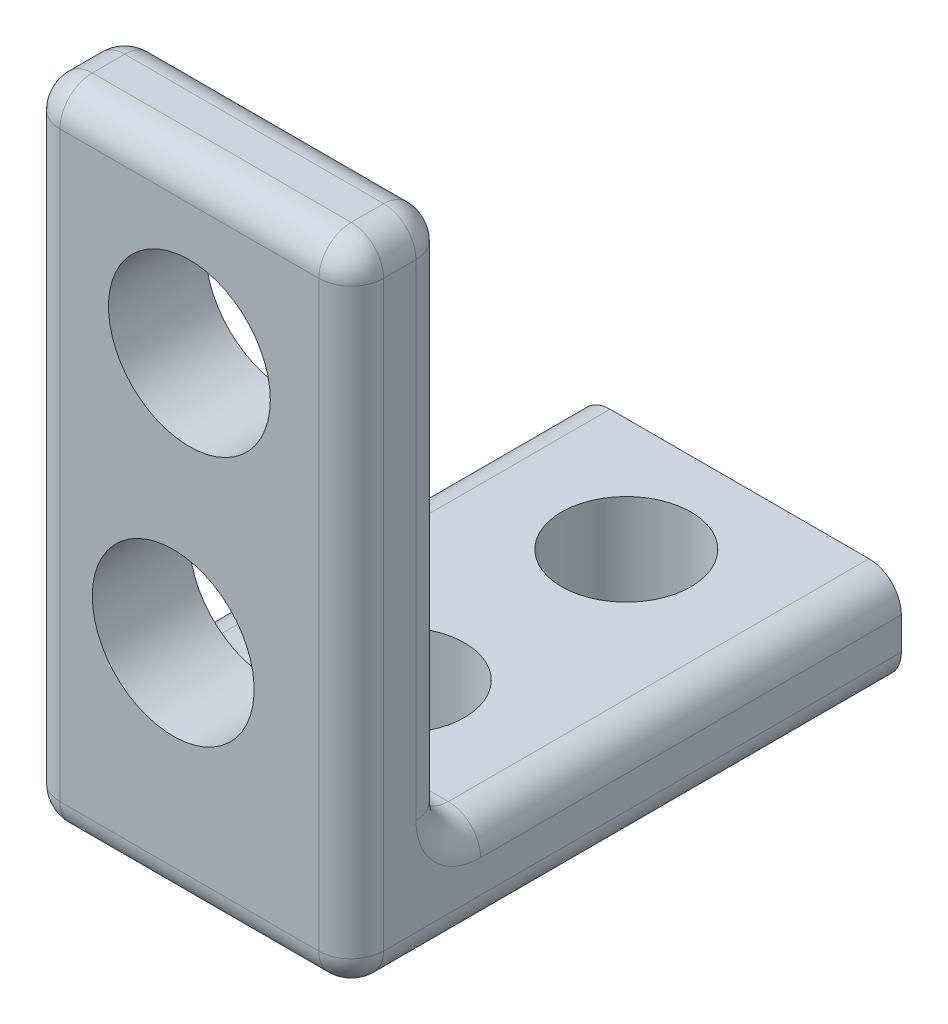
ISO-10303-21;
HEADER;
FILE_DESCRIPTION(('STEP AP214'),'2;1');
FILE_NAME('part.step','',(''),(''),'','','');
FILE_SCHEMA(('AUTOMOTIVE_DESIGN { 1 0 10303 214 1 1 1 1 }'));
ENDSEC;
DATA;
#1=APPLICATION_CONTEXT('core data for automotive mechanical design processes');
#2=APPLICATION_PROTOCOL_DEFINITION('international standard','automotive_design',2000,#1);
#3=PRODUCT_CONTEXT('',#1,'mechanical');
#4=PRODUCT('Part','Part','',(#3));
#5=PRODUCT_RELATED_PRODUCT_CATEGORY('part','',(#4));
#6=PRODUCT_DEFINITION_FORMATION('','',#4);
#7=PRODUCT_DEFINITION_CONTEXT('part definition',#1,'design');
#8=PRODUCT_DEFINITION('design','',#6,#7);
#9=PRODUCT_DEFINITION_SHAPE('','',#8);
#10=(LENGTH_UNIT() NAMED_UNIT(*) SI_UNIT(.MILLI.,.METRE.));
#11=(NAMED_UNIT(*) PLANE_ANGLE_UNIT() SI_UNIT($,.RADIAN.));
#12=(NAMED_UNIT(*) SI_UNIT($,.STERADIAN.) SOLID_ANGLE_UNIT());
#13=UNCERTAINTY_MEASURE_WITH_UNIT(LENGTH_MEASURE(1.E-05),#10,'distance_accuracy_value','');
#14=(GEOMETRIC_REPRESENTATION_CONTEXT(3) GLOBAL_UNCERTAINTY_ASSIGNED_CONTEXT((#13)) GLOBAL_UNIT_ASSIGNED_CONTEXT((#10,
#11,#12)) REPRESENTATION_CONTEXT('',''));
#15=CARTESIAN_POINT('',(0.,0.,0.));
#16=DIRECTION('',(0.,0.,1.));
#17=DIRECTION('',(1.,0.,0.));
#18=AXIS2_PLACEMENT_3D('',#15,#16,#17);
#19=CARTESIAN_POINT('',(0.,20.,0.));
#20=DIRECTION('',(1.,0.,0.));
#21=DIRECTION('',(0.,0.,-1.));
#22=AXIS2_PLACEMENT_3D('',#19,#20,#21);
#23=PLANE('',#22);
#24=DIRECTION('',(0.,1.,0.));
#25=VECTOR('',#24,1.);
#26=CARTESIAN_POINT('',(0.,0.,-17.));
#27=LINE('',#26,#25);
#28=CARTESIAN_POINT('',(0.,1.,-17.));
#29=VERTEX_POINT('',#28);
#30=CARTESIAN_POINT('',(0.,2.,-17.));
#31=VERTEX_POINT('',#30);
#32=EDGE_CURVE('E391',#29,#31,#27,.T.);
#33=ORIENTED_EDGE('',*,*,#32,.F.);
#34=DIRECTION('',(0.,0.,1.));
#35=VECTOR('',#34,1.);
#36=CARTESIAN_POINT('',(0.,1.,0.));
#37=LINE('',#36,#35);
#38=CARTESIAN_POINT('',(0.,1.,-1.));
#39=VERTEX_POINT('',#38);
#40=EDGE_CURVE('E236',#29,#39,#37,.T.);
#41=ORIENTED_EDGE('',*,*,#40,.T.);
#42=DIRECTION('',(0.,-1.,0.));
#43=VECTOR('',#42,1.);
#44=CARTESIAN_POINT('',(0.,20.,-1.));
#45=LINE('',#44,#43);
#46=CARTESIAN_POINT('',(0.,19.,-1.));
#47=VERTEX_POINT('',#46);
#48=EDGE_CURVE('E233',#39,#47,#45,.F.);
#49=ORIENTED_EDGE('',*,*,#48,.T.);
#50=DIRECTION('',(0.,0.,1.));
#51=VECTOR('',#50,1.);
#52=CARTESIAN_POINT('',(0.,19.,0.));
#53=LINE('',#52,#51);
#54=CARTESIAN_POINT('',(0.,19.,-2.));
#55=VERTEX_POINT('',#54);
#56=EDGE_CURVE('E229',#47,#55,#53,.F.);
#57=ORIENTED_EDGE('',*,*,#56,.T.);
#58=DIRECTION('',(0.,1.,0.));
#59=VECTOR('',#58,1.);
#60=CARTESIAN_POINT('',(0.,20.,-2.));
#61=LINE('',#60,#59);
#62=CARTESIAN_POINT('',(0.,4.,-2.));
#63=VERTEX_POINT('',#62);
#64=EDGE_CURVE('E223',#55,#63,#61,.F.);
#65=ORIENTED_EDGE('',*,*,#64,.T.);
#66=CARTESIAN_POINT('',(0.,4.,-4.));
#67=DIRECTION('',(1.,0.,0.));
#68=DIRECTION('',(0.,0.,-1.));
#69=AXIS2_PLACEMENT_3D('',#66,#67,#68);
#70=CIRCLE('',#69,2.);
#71=CARTESIAN_POINT('',(0.,2.,-4.));
#72=VERTEX_POINT('',#71);
#73=EDGE_CURVE('E219',#72,#63,#70,.F.);
#74=ORIENTED_EDGE('',*,*,#73,.F.);
#75=DIRECTION('',(0.,0.,1.));
#76=VECTOR('',#75,1.);
#77=CARTESIAN_POINT('',(0.,2.,-17.));
#78=LINE('',#77,#76);
#79=EDGE_CURVE('E226',#72,#31,#78,.F.);
#80=ORIENTED_EDGE('',*,*,#79,.T.);
#81=EDGE_LOOP('',(#33,#41,#49,#57,#65,#74,#80));
#82=FACE_BOUND('',#81,.T.);
#83=ADVANCED_FACE('F42',(#82),#23,.F.);
#84=CARTESIAN_POINT('',(0.,20.,0.));
#85=DIRECTION('',(0.,0.,-1.));
#86=DIRECTION('',(-1.,0.,0.));
#87=AXIS2_PLACEMENT_3D('',#84,#85,#86);
#88=PLANE('',#87);
#89=CARTESIAN_POINT('',(4.5,7.,0.));
#90=DIRECTION('',(0.,0.,-1.));
#91=DIRECTION('',(-1.,0.,0.));
#92=AXIS2_PLACEMENT_3D('',#89,#90,#91);
#93=CIRCLE('',#92,2.5);
#94=CARTESIAN_POINT('',(2.,7.,0.));
#95=VERTEX_POINT('',#94);
#96=EDGE_CURVE('E174',#95,#95,#93,.T.);
#97=ORIENTED_EDGE('',*,*,#96,.T.);
#98=EDGE_LOOP('',(#97));
#99=FACE_BOUND('',#98,.T.);
#100=DIRECTION('',(1.,0.,0.));
#101=VECTOR('',#100,1.);
#102=CARTESIAN_POINT('',(10.,1.,0.));
#103=LINE('',#102,#101);
#104=CARTESIAN_POINT('',(1.,1.,0.));
#105=VERTEX_POINT('',#104);
#106=CARTESIAN_POINT('',(9.,1.,0.));
#107=VERTEX_POINT('',#106);
#108=EDGE_CURVE('E207',#105,#107,#103,.T.);
#109=ORIENTED_EDGE('',*,*,#108,.T.);
#110=DIRECTION('',(0.,-1.,0.));
#111=VECTOR('',#110,1.);
#112=CARTESIAN_POINT('',(9.,20.,0.));
#113=LINE('',#112,#111);
#114=CARTESIAN_POINT('',(9.,19.,0.));
#115=VERTEX_POINT('',#114);
#116=EDGE_CURVE('E216',#107,#115,#113,.F.);
#117=ORIENTED_EDGE('',*,*,#116,.T.);
#118=DIRECTION('',(1.,0.,0.));
#119=VECTOR('',#118,1.);
#120=CARTESIAN_POINT('',(0.,19.,0.));
#121=LINE('',#120,#119);
#122=CARTESIAN_POINT('',(1.,19.,0.));
#123=VERTEX_POINT('',#122);
#124=EDGE_CURVE('E169',#115,#123,#121,.F.);
#125=ORIENTED_EDGE('',*,*,#124,.T.);
#126=DIRECTION('',(0.,-1.,0.));
#127=VECTOR('',#126,1.);
#128=CARTESIAN_POINT('',(1.,20.,0.));
#129=LINE('',#128,#127);
#130=EDGE_CURVE('E203',#123,#105,#129,.T.);
#131=ORIENTED_EDGE('',*,*,#130,.T.);
#132=EDGE_LOOP('',(#109,#117,#125,#131));
#133=FACE_BOUND('',#132,.T.);
#134=CARTESIAN_POINT('',(5.,15.,0.));
#135=DIRECTION('',(0.,0.,1.));
#136=DIRECTION('',(1.,0.,0.));
#137=AXIS2_PLACEMENT_3D('',#134,#135,#136);
#138=CIRCLE('',#137,2.5);
#139=CARTESIAN_POINT('',(7.5,15.,0.));
#140=VERTEX_POINT('',#139);
#141=EDGE_CURVE('E401',#140,#140,#138,.T.);
#142=ORIENTED_EDGE('',*,*,#141,.F.);
#143=EDGE_LOOP('',(#142));
#144=FACE_BOUND('',#143,.T.);
#145=ADVANCED_FACE('F435',(#99,#133,#144),#88,.F.);
#146=CARTESIAN_POINT('',(10.,20.,0.));
#147=DIRECTION('',(-1.,0.,0.));
#148=DIRECTION('',(0.,0.,1.));
#149=AXIS2_PLACEMENT_3D('',#146,#147,#148);
#150=PLANE('',#149);
#151=DIRECTION('',(0.,-1.,0.));
#152=VECTOR('',#151,1.);
#153=CARTESIAN_POINT('',(10.,20.,-1.));
#154=LINE('',#153,#152);
#155=CARTESIAN_POINT('',(10.,19.,-1.));
#156=VERTEX_POINT('',#155);
#157=CARTESIAN_POINT('',(10.,1.,-1.));
#158=VERTEX_POINT('',#157);
#159=EDGE_CURVE('E265',#156,#158,#154,.T.);
#160=ORIENTED_EDGE('',*,*,#159,.T.);
#161=DIRECTION('',(0.,0.,-1.));
#162=VECTOR('',#161,1.);
#163=CARTESIAN_POINT('',(10.,1.,-17.));
#164=LINE('',#163,#162);
#165=CARTESIAN_POINT('',(10.,1.,-17.));
#166=VERTEX_POINT('',#165);
#167=EDGE_CURVE('E268',#158,#166,#164,.T.);
#168=ORIENTED_EDGE('',*,*,#167,.T.);
#169=DIRECTION('',(0.,1.,0.));
#170=VECTOR('',#169,1.);
#171=CARTESIAN_POINT('',(10.,0.,-17.));
#172=LINE('',#171,#170);
#173=CARTESIAN_POINT('',(10.,2.,-17.));
#174=VERTEX_POINT('',#173);
#175=EDGE_CURVE('E397',#166,#174,#172,.T.);
#176=ORIENTED_EDGE('',*,*,#175,.T.);
#177=DIRECTION('',(0.,0.,-1.));
#178=VECTOR('',#177,1.);
#179=CARTESIAN_POINT('',(10.,2.,-3.));
#180=LINE('',#179,#178);
#181=CARTESIAN_POINT('',(10.,2.,-4.));
#182=VERTEX_POINT('',#181);
#183=EDGE_CURVE('E256',#174,#182,#180,.F.);
#184=ORIENTED_EDGE('',*,*,#183,.T.);
#185=CARTESIAN_POINT('',(10.,4.,-4.));
#186=DIRECTION('',(-1.,0.,0.));
#187=DIRECTION('',(0.,0.,1.));
#188=AXIS2_PLACEMENT_3D('',#185,#186,#187);
#189=CIRCLE('',#188,2.);
#190=CARTESIAN_POINT('',(10.,4.,-2.));
#191=VERTEX_POINT('',#190);
#192=EDGE_CURVE('E252',#191,#182,#189,.F.);
#193=ORIENTED_EDGE('',*,*,#192,.F.);
#194=DIRECTION('',(0.,1.,0.));
#195=VECTOR('',#194,1.);
#196=CARTESIAN_POINT('',(10.,20.,-2.));
#197=LINE('',#196,#195);
#198=CARTESIAN_POINT('',(10.,19.,-2.));
#199=VERTEX_POINT('',#198);
#200=EDGE_CURVE('E259',#191,#199,#197,.T.);
#201=ORIENTED_EDGE('',*,*,#200,.T.);
#202=DIRECTION('',(0.,0.,-1.));
#203=VECTOR('',#202,1.);
#204=CARTESIAN_POINT('',(10.,19.,0.));
#205=LINE('',#204,#203);
#206=EDGE_CURVE('E262',#199,#156,#205,.F.);
#207=ORIENTED_EDGE('',*,*,#206,.T.);
#208=EDGE_LOOP('',(#160,#168,#176,#184,#193,#201,#207));
#209=FACE_BOUND('',#208,.T.);
#210=ADVANCED_FACE('F445',(#209),#150,.F.);
#211=CARTESIAN_POINT('',(0.,20.,0.));
#212=DIRECTION('',(0.,-1.,0.));
#213=DIRECTION('',(0.,0.,-1.));
#214=AXIS2_PLACEMENT_3D('',#211,#212,#213);
#215=PLANE('',#214);
#216=DIRECTION('',(0.,0.,1.));
#217=VECTOR('',#216,1.);
#218=CARTESIAN_POINT('',(1.,20.,0.));
#219=LINE('',#218,#217);
#220=CARTESIAN_POINT('',(1.,20.,-2.));
#221=VERTEX_POINT('',#220);
#222=CARTESIAN_POINT('',(1.,20.,-1.));
#223=VERTEX_POINT('',#222);
#224=EDGE_CURVE('E200',#221,#223,#219,.T.);
#225=ORIENTED_EDGE('',*,*,#224,.T.);
#226=DIRECTION('',(1.,0.,0.));
#227=VECTOR('',#226,1.);
#228=CARTESIAN_POINT('',(0.,20.,-1.));
#229=LINE('',#228,#227);
#230=CARTESIAN_POINT('',(9.,20.,-1.));
#231=VERTEX_POINT('',#230);
#232=EDGE_CURVE('E167',#223,#231,#229,.T.);
#233=ORIENTED_EDGE('',*,*,#232,.T.);
#234=DIRECTION('',(0.,0.,-1.));
#235=VECTOR('',#234,1.);
#236=CARTESIAN_POINT('',(9.,20.,0.));
#237=LINE('',#236,#235);
#238=CARTESIAN_POINT('',(9.,20.,-2.));
#239=VERTEX_POINT('',#238);
#240=EDGE_CURVE('E188',#231,#239,#237,.T.);
#241=ORIENTED_EDGE('',*,*,#240,.T.);
#242=DIRECTION('',(1.,0.,0.));
#243=VECTOR('',#242,1.);
#244=CARTESIAN_POINT('',(0.,20.,-2.));
#245=LINE('',#244,#243);
#246=EDGE_CURVE('E195',#239,#221,#245,.F.);
#247=ORIENTED_EDGE('',*,*,#246,.T.);
#248=EDGE_LOOP('',(#225,#233,#241,#247));
#249=FACE_BOUND('',#248,.T.);
#250=ADVANCED_FACE('F198',(#249),#215,.F.);
#251=CARTESIAN_POINT('',(0.,0.,0.));
#252=DIRECTION('',(0.,-1.,0.));
#253=DIRECTION('',(0.,0.,-1.));
#254=AXIS2_PLACEMENT_3D('',#251,#252,#253);
#255=PLANE('',#254);
#256=CARTESIAN_POINT('',(5.,0.,-6.5));
#257=DIRECTION('',(0.,1.,0.));
#258=DIRECTION('',(0.,0.,1.));
#259=AXIS2_PLACEMENT_3D('',#256,#257,#258);
#260=CIRCLE('',#259,2.);
#261=CARTESIAN_POINT('',(5.,0.,-4.5));
#262=VERTEX_POINT('',#261);
#263=EDGE_CURVE('E396',#262,#262,#260,.T.);
#264=ORIENTED_EDGE('',*,*,#263,.T.);
#265=EDGE_LOOP('',(#264));
#266=FACE_BOUND('',#265,.T.);
#267=CARTESIAN_POINT('',(5.,0.,-13.5));
#268=DIRECTION('',(0.,1.,0.));
#269=DIRECTION('',(0.,0.,1.));
#270=AXIS2_PLACEMENT_3D('',#267,#268,#269);
#271=CIRCLE('',#270,2.);
#272=CARTESIAN_POINT('',(5.,0.,-11.5));
#273=VERTEX_POINT('',#272);
#274=EDGE_CURVE('E373',#273,#273,#271,.T.);
#275=ORIENTED_EDGE('',*,*,#274,.T.);
#276=EDGE_LOOP('',(#275));
#277=FACE_BOUND('',#276,.T.);
#278=DIRECTION('',(1.,0.,0.));
#279=VECTOR('',#278,1.);
#280=CARTESIAN_POINT('',(10.,0.,-17.));
#281=LINE('',#280,#279);
#282=CARTESIAN_POINT('',(0.999999999999999,0.,-17.));
#283=VERTEX_POINT('',#282);
#284=CARTESIAN_POINT('',(9.,0.,-17.));
#285=VERTEX_POINT('',#284);
#286=EDGE_CURVE('E387',#283,#285,#281,.T.);
#287=ORIENTED_EDGE('',*,*,#286,.T.);
#288=DIRECTION('',(0.,0.,-1.));
#289=VECTOR('',#288,1.);
#290=CARTESIAN_POINT('',(9.,0.,0.));
#291=LINE('',#290,#289);
#292=CARTESIAN_POINT('',(9.,0.,-1.));
#293=VERTEX_POINT('',#292);
#294=EDGE_CURVE('E277',#285,#293,#291,.F.);
#295=ORIENTED_EDGE('',*,*,#294,.T.);
#296=DIRECTION('',(1.,0.,0.));
#297=VECTOR('',#296,1.);
#298=CARTESIAN_POINT('',(0.,0.,-1.));
#299=LINE('',#298,#297);
#300=CARTESIAN_POINT('',(1.,0.,-1.));
#301=VERTEX_POINT('',#300);
#302=EDGE_CURVE('E274',#293,#301,#299,.F.);
#303=ORIENTED_EDGE('',*,*,#302,.T.);
#304=DIRECTION('',(0.,0.,1.));
#305=VECTOR('',#304,1.);
#306=CARTESIAN_POINT('',(1.,0.,-17.));
#307=LINE('',#306,#305);
#308=EDGE_CURVE('E271',#301,#283,#307,.F.);
#309=ORIENTED_EDGE('',*,*,#308,.T.);
#310=EDGE_LOOP('',(#287,#295,#303,#309));
#311=FACE_BOUND('',#310,.T.);
#312=ADVANCED_FACE('F460',(#266,#277,#311),#255,.T.);
#313=CARTESIAN_POINT('',(0.,3.,-3.));
#314=DIRECTION('',(0.,0.,1.));
#315=DIRECTION('',(1.,0.,0.));
#316=AXIS2_PLACEMENT_3D('',#313,#314,#315);
#317=PLANE('',#316);
#318=CARTESIAN_POINT('',(4.5,7.,-3.));
#319=DIRECTION('',(0.,0.,-1.));
#320=DIRECTION('',(-1.,0.,0.));
#321=AXIS2_PLACEMENT_3D('',#318,#319,#320);
#322=CIRCLE('',#321,2.5);
#323=CARTESIAN_POINT('',(2.,7.,-3.));
#324=VERTEX_POINT('',#323);
#325=EDGE_CURVE('E866',#324,#324,#322,.T.);
#326=ORIENTED_EDGE('',*,*,#325,.F.);
#327=EDGE_LOOP('',(#326));
#328=FACE_BOUND('',#327,.T.);
#329=DIRECTION('',(1.,0.,0.));
#330=VECTOR('',#329,1.);
#331=CARTESIAN_POINT('',(0.,19.,-3.));
#332=LINE('',#331,#330);
#333=CARTESIAN_POINT('',(1.,19.,-3.));
#334=VERTEX_POINT('',#333);
#335=CARTESIAN_POINT('',(9.,19.,-3.));
#336=VERTEX_POINT('',#335);
#337=EDGE_CURVE('E245',#334,#336,#332,.T.);
#338=ORIENTED_EDGE('',*,*,#337,.T.);
#339=DIRECTION('',(0.,1.,0.));
#340=VECTOR('',#339,1.);
#341=CARTESIAN_POINT('',(9.,3.,-3.));
#342=LINE('',#341,#340);
#343=CARTESIAN_POINT('',(9.,4.,-3.));
#344=VERTEX_POINT('',#343);
#345=EDGE_CURVE('E249',#336,#344,#342,.F.);
#346=ORIENTED_EDGE('',*,*,#345,.T.);
#347=DIRECTION('',(1.,0.,0.));
#348=VECTOR('',#347,1.);
#349=CARTESIAN_POINT('',(0.,4.,-3.));
#350=LINE('',#349,#348);
#351=CARTESIAN_POINT('',(1.,4.,-3.));
#352=VERTEX_POINT('',#351);
#353=EDGE_CURVE('E242',#344,#352,#350,.F.);
#354=ORIENTED_EDGE('',*,*,#353,.T.);
#355=DIRECTION('',(0.,1.,0.));
#356=VECTOR('',#355,1.);
#357=CARTESIAN_POINT('',(1.,3.,-3.));
#358=LINE('',#357,#356);
#359=EDGE_CURVE('E239',#352,#334,#358,.T.);
#360=ORIENTED_EDGE('',*,*,#359,.T.);
#361=EDGE_LOOP('',(#338,#346,#354,#360));
#362=FACE_BOUND('',#361,.T.);
#363=CARTESIAN_POINT('',(5.,15.,-3.));
#364=DIRECTION('',(0.,0.,1.));
#365=DIRECTION('',(1.,0.,0.));
#366=AXIS2_PLACEMENT_3D('',#363,#364,#365);
#367=CIRCLE('',#366,2.5);
#368=CARTESIAN_POINT('',(7.5,15.,-3.));
#369=VERTEX_POINT('',#368);
#370=EDGE_CURVE('E196',#369,#369,#367,.T.);
#371=ORIENTED_EDGE('',*,*,#370,.T.);
#372=EDGE_LOOP('',(#371));
#373=FACE_BOUND('',#372,.T.);
#374=ADVANCED_FACE('F569',(#328,#362,#373),#317,.F.);
#375=CARTESIAN_POINT('',(0.,3.,0.));
#376=DIRECTION('',(0.,1.,0.));
#377=DIRECTION('',(0.,0.,1.));
#378=AXIS2_PLACEMENT_3D('',#375,#376,#377);
#379=PLANE('',#378);
#380=CARTESIAN_POINT('',(5.,3.,-6.5));
#381=DIRECTION('',(0.,1.,0.));
#382=DIRECTION('',(0.,0.,1.));
#383=AXIS2_PLACEMENT_3D('',#380,#381,#382);
#384=CIRCLE('',#383,2.);
#385=CARTESIAN_POINT('',(5.,3.,-4.5));
#386=VERTEX_POINT('',#385);
#387=EDGE_CURVE('E383',#386,#386,#384,.T.);
#388=ORIENTED_EDGE('',*,*,#387,.F.);
#389=EDGE_LOOP('',(#388));
#390=FACE_BOUND('',#389,.T.);
#391=CARTESIAN_POINT('',(5.,3.,-13.5));
#392=DIRECTION('',(0.,1.,0.));
#393=DIRECTION('',(0.,0.,1.));
#394=AXIS2_PLACEMENT_3D('',#391,#392,#393);
#395=CIRCLE('',#394,2.);
#396=CARTESIAN_POINT('',(5.,3.,-11.5));
#397=VERTEX_POINT('',#396);
#398=EDGE_CURVE('E377',#397,#397,#395,.T.);
#399=ORIENTED_EDGE('',*,*,#398,.F.);
#400=EDGE_LOOP('',(#399));
#401=FACE_BOUND('',#400,.T.);
#402=DIRECTION('',(1.,0.,0.));
#403=VECTOR('',#402,1.);
#404=CARTESIAN_POINT('',(0.,3.,-4.));
#405=LINE('',#404,#403);
#406=CARTESIAN_POINT('',(1.,3.,-4.));
#407=VERTEX_POINT('',#406);
#408=CARTESIAN_POINT('',(9.,3.,-4.));
#409=VERTEX_POINT('',#408);
#410=EDGE_CURVE('E60',#407,#409,#405,.T.);
#411=ORIENTED_EDGE('',*,*,#410,.T.);
#412=DIRECTION('',(0.,0.,-1.));
#413=VECTOR('',#412,1.);
#414=CARTESIAN_POINT('',(9.,3.,-17.));
#415=LINE('',#414,#413);
#416=CARTESIAN_POINT('',(9.,3.,-17.));
#417=VERTEX_POINT('',#416);
#418=EDGE_CURVE('E284',#409,#417,#415,.T.);
#419=ORIENTED_EDGE('',*,*,#418,.T.);
#420=DIRECTION('',(1.,0.,0.));
#421=VECTOR('',#420,1.);
#422=CARTESIAN_POINT('',(10.,3.,-17.));
#423=LINE('',#422,#421);
#424=CARTESIAN_POINT('',(0.999999999999999,3.,-17.));
#425=VERTEX_POINT('',#424);
#426=EDGE_CURVE('E392',#425,#417,#423,.T.);
#427=ORIENTED_EDGE('',*,*,#426,.F.);
#428=DIRECTION('',(0.,0.,1.));
#429=VECTOR('',#428,1.);
#430=CARTESIAN_POINT('',(1.,3.,-3.));
#431=LINE('',#430,#429);
#432=EDGE_CURVE('E65',#425,#407,#431,.T.);
#433=ORIENTED_EDGE('',*,*,#432,.T.);
#434=EDGE_LOOP('',(#411,#419,#427,#433));
#435=FACE_BOUND('',#434,.T.);
#436=ADVANCED_FACE('F475',(#390,#401,#435),#379,.T.);
#437=CARTESIAN_POINT('',(5.,15.,-20.));
#438=DIRECTION('',(0.,0.,1.));
#439=DIRECTION('',(1.,0.,0.));
#440=AXIS2_PLACEMENT_3D('',#437,#438,#439);
#441=CYLINDRICAL_SURFACE('',#440,2.5);
#442=ORIENTED_EDGE('',*,*,#141,.T.);
#443=EDGE_LOOP('',(#442));
#444=FACE_BOUND('',#443,.T.);
#445=ORIENTED_EDGE('',*,*,#370,.F.);
#446=EDGE_LOOP('',(#445));
#447=FACE_BOUND('',#446,.T.);
#448=ADVANCED_FACE('F615',(#444,#447),#441,.F.);
#449=CARTESIAN_POINT('',(10.,0.,-17.));
#450=DIRECTION('',(0.,0.,1.));
#451=DIRECTION('',(1.,0.,0.));
#452=AXIS2_PLACEMENT_3D('',#449,#450,#451);
#453=PLANE('',#452);
#454=ORIENTED_EDGE('',*,*,#175,.F.);
#455=CARTESIAN_POINT('',(9.,1.,-17.));
#456=DIRECTION('',(0.,0.,1.));
#457=DIRECTION('',(1.,0.,0.));
#458=AXIS2_PLACEMENT_3D('',#455,#456,#457);
#459=CIRCLE('',#458,1.);
#460=EDGE_CURVE('E11',#166,#285,#459,.F.);
#461=ORIENTED_EDGE('',*,*,#460,.T.);
#462=ORIENTED_EDGE('',*,*,#286,.F.);
#463=CARTESIAN_POINT('',(1.,1.,-17.));
#464=DIRECTION('',(0.,0.,1.));
#465=DIRECTION('',(1.,0.,0.));
#466=AXIS2_PLACEMENT_3D('',#463,#464,#465);
#467=CIRCLE('',#466,1.);
#468=EDGE_CURVE('E290',#283,#29,#467,.F.);
#469=ORIENTED_EDGE('',*,*,#468,.T.);
#470=ORIENTED_EDGE('',*,*,#32,.T.);
#471=CARTESIAN_POINT('',(1.,2.,-17.));
#472=DIRECTION('',(0.,0.,1.));
#473=DIRECTION('',(1.,0.,0.));
#474=AXIS2_PLACEMENT_3D('',#471,#472,#473);
#475=CIRCLE('',#474,1.);
#476=EDGE_CURVE('E287',#31,#425,#475,.F.);
#477=ORIENTED_EDGE('',*,*,#476,.T.);
#478=ORIENTED_EDGE('',*,*,#426,.T.);
#479=CARTESIAN_POINT('',(9.,2.,-17.));
#480=DIRECTION('',(0.,0.,1.));
#481=DIRECTION('',(1.,0.,0.));
#482=AXIS2_PLACEMENT_3D('',#479,#480,#481);
#483=CIRCLE('',#482,1.);
#484=EDGE_CURVE('E52',#417,#174,#483,.F.);
#485=ORIENTED_EDGE('',*,*,#484,.T.);
#486=EDGE_LOOP('',(#454,#461,#462,#469,#470,#477,#478,#485));
#487=FACE_BOUND('',#486,.T.);
#488=ADVANCED_FACE('F469',(#487),#453,.F.);
#489=CARTESIAN_POINT('',(5.,0.,-13.5));
#490=DIRECTION('',(0.,1.,0.));
#491=DIRECTION('',(0.,0.,1.));
#492=AXIS2_PLACEMENT_3D('',#489,#490,#491);
#493=CYLINDRICAL_SURFACE('',#492,2.);
#494=ORIENTED_EDGE('',*,*,#274,.F.);
#495=EDGE_LOOP('',(#494));
#496=FACE_BOUND('',#495,.T.);
#497=ORIENTED_EDGE('',*,*,#398,.T.);
#498=EDGE_LOOP('',(#497));
#499=FACE_BOUND('',#498,.T.);
#500=ADVANCED_FACE('F624',(#496,#499),#493,.F.);
#501=CARTESIAN_POINT('',(5.,0.,-6.5));
#502=DIRECTION('',(0.,1.,0.));
#503=DIRECTION('',(0.,0.,1.));
#504=AXIS2_PLACEMENT_3D('',#501,#502,#503);
#505=CYLINDRICAL_SURFACE('',#504,2.);
#506=ORIENTED_EDGE('',*,*,#263,.F.);
#507=EDGE_LOOP('',(#506));
#508=FACE_BOUND('',#507,.T.);
#509=ORIENTED_EDGE('',*,*,#387,.T.);
#510=EDGE_LOOP('',(#509));
#511=FACE_BOUND('',#510,.T.);
#512=ADVANCED_FACE('F633',(#508,#511),#505,.F.);
#513=CARTESIAN_POINT('',(1.,2.,0.));
#514=DIRECTION('',(0.,0.,-1.));
#515=DIRECTION('',(-1.,0.,0.));
#516=AXIS2_PLACEMENT_3D('',#513,#514,#515);
#517=CYLINDRICAL_SURFACE('',#516,1.);
#518=ORIENTED_EDGE('',*,*,#476,.F.);
#519=ORIENTED_EDGE('',*,*,#79,.F.);
#520=CARTESIAN_POINT('',(1.,2.,-4.));
#521=DIRECTION('',(0.,0.,1.));
#522=DIRECTION('',(1.,0.,0.));
#523=AXIS2_PLACEMENT_3D('',#520,#521,#522);
#524=CIRCLE('',#523,1.);
#525=EDGE_CURVE('E46',#407,#72,#524,.T.);
#526=ORIENTED_EDGE('',*,*,#525,.F.);
#527=ORIENTED_EDGE('',*,*,#432,.F.);
#528=EDGE_LOOP('',(#518,#519,#526,#527));
#529=FACE_BOUND('',#528,.T.);
#530=ADVANCED_FACE('F44',(#529),#517,.T.);
#531=CARTESIAN_POINT('',(0.,4.,-4.));
#532=DIRECTION('',(1.,0.,0.));
#533=DIRECTION('',(0.,0.,-1.));
#534=AXIS2_PLACEMENT_3D('',#531,#532,#533);
#535=CYLINDRICAL_SURFACE('',#534,1.);
#536=CARTESIAN_POINT('',(9.,4.,-4.));
#537=DIRECTION('',(-1.,0.,0.));
#538=DIRECTION('',(0.,0.,1.));
#539=AXIS2_PLACEMENT_3D('',#536,#537,#538);
#540=CIRCLE('',#539,1.);
#541=EDGE_CURVE('E362',#409,#344,#540,.T.);
#542=ORIENTED_EDGE('',*,*,#541,.F.);
#543=ORIENTED_EDGE('',*,*,#410,.F.);
#544=CARTESIAN_POINT('',(1.,4.,-4.));
#545=DIRECTION('',(1.,0.,0.));
#546=DIRECTION('',(0.,0.,-1.));
#547=AXIS2_PLACEMENT_3D('',#544,#545,#546);
#548=CIRCLE('',#547,1.);
#549=EDGE_CURVE('E365',#352,#407,#548,.T.);
#550=ORIENTED_EDGE('',*,*,#549,.F.);
#551=ORIENTED_EDGE('',*,*,#353,.F.);
#552=EDGE_LOOP('',(#542,#543,#550,#551));
#553=FACE_BOUND('',#552,.T.);
#554=ADVANCED_FACE('F483',(#553),#535,.F.);
#555=CARTESIAN_POINT('',(9.,2.,0.));
#556=DIRECTION('',(0.,0.,1.));
#557=DIRECTION('',(1.,0.,0.));
#558=AXIS2_PLACEMENT_3D('',#555,#556,#557);
#559=CYLINDRICAL_SURFACE('',#558,1.);
#560=ORIENTED_EDGE('',*,*,#484,.F.);
#561=ORIENTED_EDGE('',*,*,#418,.F.);
#562=CARTESIAN_POINT('',(9.,2.,-4.));
#563=DIRECTION('',(0.,0.,1.));
#564=DIRECTION('',(1.,0.,0.));
#565=AXIS2_PLACEMENT_3D('',#562,#563,#564);
#566=CIRCLE('',#565,1.);
#567=EDGE_CURVE('E358',#182,#409,#566,.T.);
#568=ORIENTED_EDGE('',*,*,#567,.F.);
#569=ORIENTED_EDGE('',*,*,#183,.F.);
#570=EDGE_LOOP('',(#560,#561,#568,#569));
#571=FACE_BOUND('',#570,.T.);
#572=ADVANCED_FACE('F479',(#571),#559,.T.);
#573=CARTESIAN_POINT('',(1.,4.,-4.));
#574=DIRECTION('',(1.,0.,0.));
#575=DIRECTION('',(0.,0.,-1.));
#576=AXIS2_PLACEMENT_3D('',#573,#574,#575);
#577=TOROIDAL_SURFACE('',#576,2.,1.);
#578=ORIENTED_EDGE('',*,*,#525,.T.);
#579=ORIENTED_EDGE('',*,*,#73,.T.);
#580=CARTESIAN_POINT('',(1.,4.,-2.));
#581=DIRECTION('',(0.,-1.,0.));
#582=DIRECTION('',(0.,0.,-1.));
#583=AXIS2_PLACEMENT_3D('',#580,#581,#582);
#584=CIRCLE('',#583,1.);
#585=EDGE_CURVE('E354',#352,#63,#584,.F.);
#586=ORIENTED_EDGE('',*,*,#585,.F.);
#587=ORIENTED_EDGE('',*,*,#549,.T.);
#588=EDGE_LOOP('',(#578,#579,#586,#587));
#589=FACE_BOUND('',#588,.T.);
#590=ADVANCED_FACE('F652',(#589),#577,.T.);
#591=CARTESIAN_POINT('',(9.,4.,-4.));
#592=DIRECTION('',(-1.,0.,0.));
#593=DIRECTION('',(0.,0.,1.));
#594=AXIS2_PLACEMENT_3D('',#591,#592,#593);
#595=TOROIDAL_SURFACE('',#594,2.,1.);
#596=ORIENTED_EDGE('',*,*,#567,.T.);
#597=ORIENTED_EDGE('',*,*,#541,.T.);
#598=CARTESIAN_POINT('',(9.,4.,-2.));
#599=DIRECTION('',(0.,-1.,0.));
#600=DIRECTION('',(0.,0.,-1.));
#601=AXIS2_PLACEMENT_3D('',#598,#599,#600);
#602=CIRCLE('',#601,1.);
#603=EDGE_CURVE('E350',#191,#344,#602,.F.);
#604=ORIENTED_EDGE('',*,*,#603,.F.);
#605=ORIENTED_EDGE('',*,*,#192,.T.);
#606=EDGE_LOOP('',(#596,#597,#604,#605));
#607=FACE_BOUND('',#606,.T.);
#608=ADVANCED_FACE('F486',(#607),#595,.T.);
#609=CARTESIAN_POINT('',(1.,1.,0.));
#610=DIRECTION('',(0.,0.,-1.));
#611=DIRECTION('',(-1.,0.,0.));
#612=AXIS2_PLACEMENT_3D('',#609,#610,#611);
#613=CYLINDRICAL_SURFACE('',#612,1.);
#614=ORIENTED_EDGE('',*,*,#468,.F.);
#615=ORIENTED_EDGE('',*,*,#308,.F.);
#616=CARTESIAN_POINT('',(1.,1.,-1.));
#617=DIRECTION('',(0.,0.,1.));
#618=DIRECTION('',(1.,0.,0.));
#619=AXIS2_PLACEMENT_3D('',#616,#617,#618);
#620=CIRCLE('',#619,1.);
#621=EDGE_CURVE('E342',#39,#301,#620,.T.);
#622=ORIENTED_EDGE('',*,*,#621,.F.);
#623=ORIENTED_EDGE('',*,*,#40,.F.);
#624=EDGE_LOOP('',(#614,#615,#622,#623));
#625=FACE_BOUND('',#624,.T.);
#626=ADVANCED_FACE('F465',(#625),#613,.T.);
#627=CARTESIAN_POINT('',(1.,3.,-2.));
#628=DIRECTION('',(0.,1.,0.));
#629=DIRECTION('',(0.,0.,1.));
#630=AXIS2_PLACEMENT_3D('',#627,#628,#629);
#631=CYLINDRICAL_SURFACE('',#630,1.);
#632=ORIENTED_EDGE('',*,*,#585,.T.);
#633=ORIENTED_EDGE('',*,*,#64,.F.);
#634=CARTESIAN_POINT('',(1.,19.,-2.));
#635=DIRECTION('',(0.,1.,0.));
#636=DIRECTION('',(0.,0.,1.));
#637=AXIS2_PLACEMENT_3D('',#634,#635,#636);
#638=CIRCLE('',#637,1.);
#639=EDGE_CURVE('E338',#334,#55,#638,.T.);
#640=ORIENTED_EDGE('',*,*,#639,.F.);
#641=ORIENTED_EDGE('',*,*,#359,.F.);
#642=EDGE_LOOP('',(#632,#633,#640,#641));
#643=FACE_BOUND('',#642,.T.);
#644=ADVANCED_FACE('F680',(#643),#631,.T.);
#645=CARTESIAN_POINT('',(0.,19.,-2.));
#646=DIRECTION('',(1.,0.,0.));
#647=DIRECTION('',(0.,0.,-1.));
#648=AXIS2_PLACEMENT_3D('',#645,#646,#647);
#649=CYLINDRICAL_SURFACE('',#648,1.);
#650=CARTESIAN_POINT('',(9.,19.,-2.));
#651=DIRECTION('',(1.,0.,0.));
#652=DIRECTION('',(0.,0.,-1.));
#653=AXIS2_PLACEMENT_3D('',#650,#651,#652);
#654=CIRCLE('',#653,1.);
#655=EDGE_CURVE('E330',#336,#239,#654,.T.);
#656=ORIENTED_EDGE('',*,*,#655,.F.);
#657=ORIENTED_EDGE('',*,*,#337,.F.);
#658=CARTESIAN_POINT('',(1.,19.,-2.));
#659=DIRECTION('',(-1.,0.,0.));
#660=DIRECTION('',(0.,0.,1.));
#661=AXIS2_PLACEMENT_3D('',#658,#659,#660);
#662=CIRCLE('',#661,1.);
#663=EDGE_CURVE('E334',#221,#334,#662,.T.);
#664=ORIENTED_EDGE('',*,*,#663,.F.);
#665=ORIENTED_EDGE('',*,*,#246,.F.);
#666=EDGE_LOOP('',(#656,#657,#664,#665));
#667=FACE_BOUND('',#666,.T.);
#668=ADVANCED_FACE('F416',(#667),#649,.T.);
#669=CARTESIAN_POINT('',(9.,20.,-2.));
#670=DIRECTION('',(0.,1.,0.));
#671=DIRECTION('',(0.,0.,1.));
#672=AXIS2_PLACEMENT_3D('',#669,#670,#671);
#673=CYLINDRICAL_SURFACE('',#672,1.);
#674=ORIENTED_EDGE('',*,*,#603,.T.);
#675=ORIENTED_EDGE('',*,*,#345,.F.);
#676=CARTESIAN_POINT('',(9.,19.,-2.));
#677=DIRECTION('',(0.,1.,0.));
#678=DIRECTION('',(0.,0.,1.));
#679=AXIS2_PLACEMENT_3D('',#676,#677,#678);
#680=CIRCLE('',#679,1.);
#681=EDGE_CURVE('E327',#199,#336,#680,.T.);
#682=ORIENTED_EDGE('',*,*,#681,.F.);
#683=ORIENTED_EDGE('',*,*,#200,.F.);
#684=EDGE_LOOP('',(#674,#675,#682,#683));
#685=FACE_BOUND('',#684,.T.);
#686=ADVANCED_FACE('F491',(#685),#673,.T.);
#687=CARTESIAN_POINT('',(9.,1.,0.));
#688=DIRECTION('',(0.,0.,1.));
#689=DIRECTION('',(1.,0.,0.));
#690=AXIS2_PLACEMENT_3D('',#687,#688,#689);
#691=CYLINDRICAL_SURFACE('',#690,1.);
#692=ORIENTED_EDGE('',*,*,#460,.F.);
#693=ORIENTED_EDGE('',*,*,#167,.F.);
#694=CARTESIAN_POINT('',(9.,1.,-1.));
#695=DIRECTION('',(0.,0.,1.));
#696=DIRECTION('',(1.,0.,0.));
#697=AXIS2_PLACEMENT_3D('',#694,#695,#696);
#698=CIRCLE('',#697,1.);
#699=EDGE_CURVE('E323',#293,#158,#698,.T.);
#700=ORIENTED_EDGE('',*,*,#699,.F.);
#701=ORIENTED_EDGE('',*,*,#294,.F.);
#702=EDGE_LOOP('',(#692,#693,#700,#701));
#703=FACE_BOUND('',#702,.T.);
#704=ADVANCED_FACE('F450',(#703),#691,.T.);
#705=CARTESIAN_POINT('',(0.,1.,-1.));
#706=DIRECTION('',(-1.,0.,0.));
#707=DIRECTION('',(0.,0.,1.));
#708=AXIS2_PLACEMENT_3D('',#705,#706,#707);
#709=CYLINDRICAL_SURFACE('',#708,1.);
#710=CARTESIAN_POINT('',(1.,1.,-1.));
#711=DIRECTION('',(-1.,0.,0.));
#712=DIRECTION('',(0.,0.,1.));
#713=AXIS2_PLACEMENT_3D('',#710,#711,#712);
#714=CIRCLE('',#713,1.);
#715=EDGE_CURVE('E346',#301,#105,#714,.T.);
#716=ORIENTED_EDGE('',*,*,#715,.F.);
#717=ORIENTED_EDGE('',*,*,#302,.F.);
#718=CARTESIAN_POINT('',(9.,1.,-1.));
#719=DIRECTION('',(1.,0.,0.));
#720=DIRECTION('',(0.,0.,-1.));
#721=AXIS2_PLACEMENT_3D('',#718,#719,#720);
#722=CIRCLE('',#721,1.);
#723=EDGE_CURVE('E319',#107,#293,#722,.T.);
#724=ORIENTED_EDGE('',*,*,#723,.F.);
#725=ORIENTED_EDGE('',*,*,#108,.F.);
#726=EDGE_LOOP('',(#716,#717,#724,#725));
#727=FACE_BOUND('',#726,.T.);
#728=ADVANCED_FACE('F457',(#727),#709,.T.);
#729=CARTESIAN_POINT('',(1.,1.,-1.));
#730=DIRECTION('',(0.,-1.,0.));
#731=DIRECTION('',(0.,0.,-1.));
#732=AXIS2_PLACEMENT_3D('',#729,#730,#731);
#733=SPHERICAL_SURFACE('',#732,1.);
#734=ORIENTED_EDGE('',*,*,#621,.T.);
#735=ORIENTED_EDGE('',*,*,#715,.T.);
#736=CARTESIAN_POINT('',(1.,1.,-1.));
#737=DIRECTION('',(0.,-1.,0.));
#738=DIRECTION('',(0.,0.,-1.));
#739=AXIS2_PLACEMENT_3D('',#736,#737,#738);
#740=CIRCLE('',#739,1.);
#741=EDGE_CURVE('E315',#39,#105,#740,.F.);
#742=ORIENTED_EDGE('',*,*,#741,.F.);
#743=EDGE_LOOP('',(#734,#735,#742));
#744=FACE_BOUND('',#743,.T.);
#745=ADVANCED_FACE('F501',(#744),#733,.T.);
#746=CARTESIAN_POINT('',(1.,19.,-2.));
#747=DIRECTION('',(0.,0.,-1.));
#748=DIRECTION('',(-1.,0.,0.));
#749=AXIS2_PLACEMENT_3D('',#746,#747,#748);
#750=SPHERICAL_SURFACE('',#749,1.);
#751=ORIENTED_EDGE('',*,*,#663,.T.);
#752=ORIENTED_EDGE('',*,*,#639,.T.);
#753=CARTESIAN_POINT('',(1.,19.,-2.));
#754=DIRECTION('',(0.,0.,-1.));
#755=DIRECTION('',(-1.,0.,0.));
#756=AXIS2_PLACEMENT_3D('',#753,#754,#755);
#757=CIRCLE('',#756,1.);
#758=EDGE_CURVE('E312',#221,#55,#757,.F.);
#759=ORIENTED_EDGE('',*,*,#758,.F.);
#760=EDGE_LOOP('',(#751,#752,#759));
#761=FACE_BOUND('',#760,.T.);
#762=ADVANCED_FACE('F419',(#761),#750,.T.);
#763=CARTESIAN_POINT('',(9.,19.,-2.));
#764=DIRECTION('',(0.,0.,-1.));
#765=DIRECTION('',(-1.,0.,0.));
#766=AXIS2_PLACEMENT_3D('',#763,#764,#765);
#767=SPHERICAL_SURFACE('',#766,1.);
#768=ORIENTED_EDGE('',*,*,#681,.T.);
#769=ORIENTED_EDGE('',*,*,#655,.T.);
#770=CARTESIAN_POINT('',(9.,19.,-2.));
#771=DIRECTION('',(0.,0.,-1.));
#772=DIRECTION('',(-1.,0.,0.));
#773=AXIS2_PLACEMENT_3D('',#770,#771,#772);
#774=CIRCLE('',#773,1.);
#775=EDGE_CURVE('E191',#199,#239,#774,.F.);
#776=ORIENTED_EDGE('',*,*,#775,.F.);
#777=EDGE_LOOP('',(#768,#769,#776));
#778=FACE_BOUND('',#777,.T.);
#779=ADVANCED_FACE('F493',(#778),#767,.T.);
#780=CARTESIAN_POINT('',(9.,1.,-1.));
#781=DIRECTION('',(0.,-1.,0.));
#782=DIRECTION('',(0.,0.,-1.));
#783=AXIS2_PLACEMENT_3D('',#780,#781,#782);
#784=SPHERICAL_SURFACE('',#783,1.);
#785=ORIENTED_EDGE('',*,*,#723,.T.);
#786=ORIENTED_EDGE('',*,*,#699,.T.);
#787=CARTESIAN_POINT('',(9.,1.,-1.));
#788=DIRECTION('',(0.,-1.,0.));
#789=DIRECTION('',(0.,0.,-1.));
#790=AXIS2_PLACEMENT_3D('',#787,#788,#789);
#791=CIRCLE('',#790,1.);
#792=EDGE_CURVE('E306',#107,#158,#791,.F.);
#793=ORIENTED_EDGE('',*,*,#792,.F.);
#794=EDGE_LOOP('',(#785,#786,#793));
#795=FACE_BOUND('',#794,.T.);
#796=ADVANCED_FACE('F453',(#795),#784,.T.);
#797=CARTESIAN_POINT('',(1.,20.,-1.));
#798=DIRECTION('',(0.,-1.,0.));
#799=DIRECTION('',(0.,0.,-1.));
#800=AXIS2_PLACEMENT_3D('',#797,#798,#799);
#801=CYLINDRICAL_SURFACE('',#800,1.);
#802=ORIENTED_EDGE('',*,*,#741,.T.);
#803=ORIENTED_EDGE('',*,*,#130,.F.);
#804=CARTESIAN_POINT('',(1.,19.,-1.));
#805=DIRECTION('',(0.,1.,0.));
#806=DIRECTION('',(0.,0.,1.));
#807=AXIS2_PLACEMENT_3D('',#804,#805,#806);
#808=CIRCLE('',#807,1.);
#809=EDGE_CURVE('E302',#47,#123,#808,.T.);
#810=ORIENTED_EDGE('',*,*,#809,.F.);
#811=ORIENTED_EDGE('',*,*,#48,.F.);
#812=EDGE_LOOP('',(#802,#803,#810,#811));
#813=FACE_BOUND('',#812,.T.);
#814=ADVANCED_FACE('F431',(#813),#801,.T.);
#815=CARTESIAN_POINT('',(1.,19.,0.));
#816=DIRECTION('',(0.,0.,1.));
#817=DIRECTION('',(1.,0.,0.));
#818=AXIS2_PLACEMENT_3D('',#815,#816,#817);
#819=CYLINDRICAL_SURFACE('',#818,1.);
#820=ORIENTED_EDGE('',*,*,#758,.T.);
#821=ORIENTED_EDGE('',*,*,#56,.F.);
#822=CARTESIAN_POINT('',(1.,19.,-1.));
#823=DIRECTION('',(0.,0.,1.));
#824=DIRECTION('',(1.,0.,0.));
#825=AXIS2_PLACEMENT_3D('',#822,#823,#824);
#826=CIRCLE('',#825,1.);
#827=EDGE_CURVE('E185',#223,#47,#826,.T.);
#828=ORIENTED_EDGE('',*,*,#827,.F.);
#829=ORIENTED_EDGE('',*,*,#224,.F.);
#830=EDGE_LOOP('',(#820,#821,#828,#829));
#831=FACE_BOUND('',#830,.T.);
#832=ADVANCED_FACE('F423',(#831),#819,.T.);
#833=CARTESIAN_POINT('',(9.,19.,0.));
#834=DIRECTION('',(0.,0.,-1.));
#835=DIRECTION('',(-1.,0.,0.));
#836=AXIS2_PLACEMENT_3D('',#833,#834,#835);
#837=CYLINDRICAL_SURFACE('',#836,1.);
#838=ORIENTED_EDGE('',*,*,#775,.T.);
#839=ORIENTED_EDGE('',*,*,#240,.F.);
#840=CARTESIAN_POINT('',(9.,19.,-1.));
#841=DIRECTION('',(0.,0.,1.));
#842=DIRECTION('',(1.,0.,0.));
#843=AXIS2_PLACEMENT_3D('',#840,#841,#842);
#844=CIRCLE('',#843,1.);
#845=EDGE_CURVE('E177',#156,#231,#844,.T.);
#846=ORIENTED_EDGE('',*,*,#845,.F.);
#847=ORIENTED_EDGE('',*,*,#206,.F.);
#848=EDGE_LOOP('',(#838,#839,#846,#847));
#849=FACE_BOUND('',#848,.T.);
#850=ADVANCED_FACE('F189',(#849),#837,.T.);
#851=CARTESIAN_POINT('',(9.,20.,-1.));
#852=DIRECTION('',(0.,-1.,0.));
#853=DIRECTION('',(0.,0.,-1.));
#854=AXIS2_PLACEMENT_3D('',#851,#852,#853);
#855=CYLINDRICAL_SURFACE('',#854,1.);
#856=ORIENTED_EDGE('',*,*,#792,.T.);
#857=ORIENTED_EDGE('',*,*,#159,.F.);
#858=CARTESIAN_POINT('',(9.,19.,-1.));
#859=DIRECTION('',(0.,1.,0.));
#860=DIRECTION('',(0.,0.,1.));
#861=AXIS2_PLACEMENT_3D('',#858,#859,#860);
#862=CIRCLE('',#861,1.);
#863=EDGE_CURVE('E181',#115,#156,#862,.T.);
#864=ORIENTED_EDGE('',*,*,#863,.F.);
#865=ORIENTED_EDGE('',*,*,#116,.F.);
#866=EDGE_LOOP('',(#856,#857,#864,#865));
#867=FACE_BOUND('',#866,.T.);
#868=ADVANCED_FACE('F441',(#867),#855,.T.);
#869=CARTESIAN_POINT('',(1.,19.,-1.));
#870=DIRECTION('',(-1.,0.,0.));
#871=DIRECTION('',(0.,0.,1.));
#872=AXIS2_PLACEMENT_3D('',#869,#870,#871);
#873=SPHERICAL_SURFACE('',#872,1.);
#874=ORIENTED_EDGE('',*,*,#827,.T.);
#875=ORIENTED_EDGE('',*,*,#809,.T.);
#876=CARTESIAN_POINT('',(1.,19.,-1.));
#877=DIRECTION('',(-1.,0.,0.));
#878=DIRECTION('',(0.,0.,1.));
#879=AXIS2_PLACEMENT_3D('',#876,#877,#878);
#880=CIRCLE('',#879,1.);
#881=EDGE_CURVE('E173',#223,#123,#880,.F.);
#882=ORIENTED_EDGE('',*,*,#881,.F.);
#883=EDGE_LOOP('',(#874,#875,#882));
#884=FACE_BOUND('',#883,.T.);
#885=ADVANCED_FACE('F427',(#884),#873,.T.);
#886=CARTESIAN_POINT('',(9.,19.,-1.));
#887=DIRECTION('',(1.,0.,0.));
#888=DIRECTION('',(0.,0.,-1.));
#889=AXIS2_PLACEMENT_3D('',#886,#887,#888);
#890=SPHERICAL_SURFACE('',#889,1.);
#891=ORIENTED_EDGE('',*,*,#863,.T.);
#892=ORIENTED_EDGE('',*,*,#845,.T.);
#893=CARTESIAN_POINT('',(9.,19.,-1.));
#894=DIRECTION('',(1.,0.,0.));
#895=DIRECTION('',(0.,0.,-1.));
#896=AXIS2_PLACEMENT_3D('',#893,#894,#895);
#897=CIRCLE('',#896,1.);
#898=EDGE_CURVE('E163',#115,#231,#897,.F.);
#899=ORIENTED_EDGE('',*,*,#898,.F.);
#900=EDGE_LOOP('',(#891,#892,#899));
#901=FACE_BOUND('',#900,.T.);
#902=ADVANCED_FACE('F179',(#901),#890,.T.);
#903=CARTESIAN_POINT('',(0.,19.,-1.));
#904=DIRECTION('',(1.,0.,0.));
#905=DIRECTION('',(0.,0.,-1.));
#906=AXIS2_PLACEMENT_3D('',#903,#904,#905);
#907=CYLINDRICAL_SURFACE('',#906,1.);
#908=ORIENTED_EDGE('',*,*,#881,.T.);
#909=ORIENTED_EDGE('',*,*,#124,.F.);
#910=ORIENTED_EDGE('',*,*,#898,.T.);
#911=ORIENTED_EDGE('',*,*,#232,.F.);
#912=EDGE_LOOP('',(#908,#909,#910,#911));
#913=FACE_BOUND('',#912,.T.);
#914=ADVANCED_FACE('F165',(#913),#907,.T.);
#915=CARTESIAN_POINT('',(4.5,7.,0.));
#916=DIRECTION('',(0.,0.,-1.));
#917=DIRECTION('',(-1.,0.,0.));
#918=AXIS2_PLACEMENT_3D('',#915,#916,#917);
#919=CYLINDRICAL_SURFACE('',#918,2.5);
#920=ORIENTED_EDGE('',*,*,#96,.F.);
#921=EDGE_LOOP('',(#920));
#922=FACE_BOUND('',#921,.T.);
#923=ORIENTED_EDGE('',*,*,#325,.T.);
#924=EDGE_LOOP('',(#923));
#925=FACE_BOUND('',#924,.T.);
#926=ADVANCED_FACE('F516',(#922,#925),#919,.F.);
#927=CLOSED_SHELL('',(#83,#145,#210,#250,#312,#374,#436,#448,#488,#500,#512,#530,#554,#572,#590,
#608,#626,#644,#668,#686,#704,#728,#745,#762,#779,#796,#814,#832,#850,#868,#885,#902,#914,#926));
#928=MANIFOLD_SOLID_BREP('B2',#927);
#929=ADVANCED_BREP_SHAPE_REPRESENTATION('',(#18,#928),#14);
#930=SHAPE_DEFINITION_REPRESENTATION(#9,#929);
ENDSEC;
END-ISO-10303-21;
